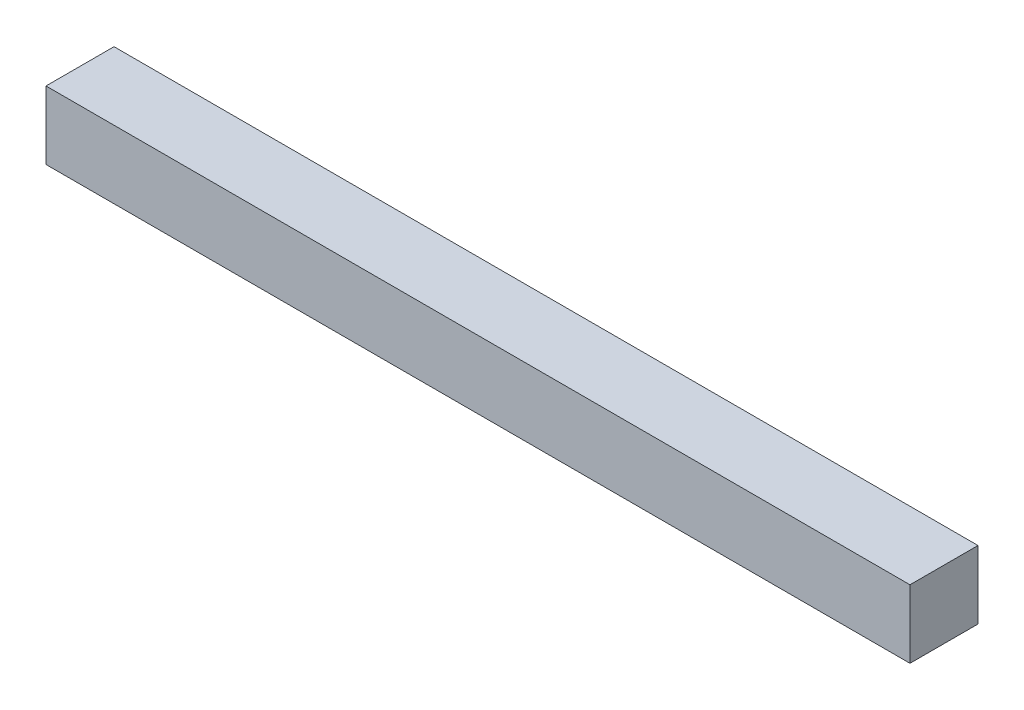
ISO-10303-21;
HEADER;
FILE_DESCRIPTION(('STEP AP214'),'2;1');
FILE_NAME('part.step','',(''),(''),'','','');
FILE_SCHEMA(('AUTOMOTIVE_DESIGN { 1 0 10303 214 1 1 1 1 }'));
ENDSEC;
DATA;
#1=APPLICATION_CONTEXT('core data for automotive mechanical design processes');
#2=APPLICATION_PROTOCOL_DEFINITION('international standard','automotive_design',2000,#1);
#3=PRODUCT_CONTEXT('',#1,'mechanical');
#4=PRODUCT('Part','Part','',(#3));
#5=PRODUCT_RELATED_PRODUCT_CATEGORY('part','',(#4));
#6=PRODUCT_DEFINITION_FORMATION('','',#4);
#7=PRODUCT_DEFINITION_CONTEXT('part definition',#1,'design');
#8=PRODUCT_DEFINITION('design','',#6,#7);
#9=PRODUCT_DEFINITION_SHAPE('','',#8);
#10=(LENGTH_UNIT() NAMED_UNIT(*) SI_UNIT(.MILLI.,.METRE.));
#11=(NAMED_UNIT(*) PLANE_ANGLE_UNIT() SI_UNIT($,.RADIAN.));
#12=(NAMED_UNIT(*) SI_UNIT($,.STERADIAN.) SOLID_ANGLE_UNIT());
#13=UNCERTAINTY_MEASURE_WITH_UNIT(LENGTH_MEASURE(1.E-05),#10,'distance_accuracy_value','');
#14=(GEOMETRIC_REPRESENTATION_CONTEXT(3) GLOBAL_UNCERTAINTY_ASSIGNED_CONTEXT((#13)) GLOBAL_UNIT_ASSIGNED_CONTEXT((#10,
#11,#12)) REPRESENTATION_CONTEXT('',''));
#15=CARTESIAN_POINT('',(0.,0.,0.));
#16=DIRECTION('',(0.,0.,1.));
#17=DIRECTION('',(1.,0.,0.));
#18=AXIS2_PLACEMENT_3D('',#15,#16,#17);
#19=CARTESIAN_POINT('',(-14.700580947984,5.16081871345029,10.));
#20=DIRECTION('',(0.,1.,0.));
#21=DIRECTION('',(0.,0.,1.));
#22=AXIS2_PLACEMENT_3D('',#19,#20,#21);
#23=PLANE('',#22);
#24=DIRECTION('',(1.,0.,0.));
#25=VECTOR('',#24,1.);
#26=CARTESIAN_POINT('',(-14.700580947984,5.16081871345029,0.));
#27=LINE('',#26,#25);
#28=CARTESIAN_POINT('',(-14.700580947984,5.16081871345029,0.));
#29=VERTEX_POINT('',#28);
#30=CARTESIAN_POINT('',(112.299419052016,5.16081871345029,0.));
#31=VERTEX_POINT('',#30);
#32=EDGE_CURVE('E98',#29,#31,#27,.T.);
#33=ORIENTED_EDGE('',*,*,#32,.F.);
#34=DIRECTION('',(0.,0.,-1.));
#35=VECTOR('',#34,1.);
#36=CARTESIAN_POINT('',(-14.700580947984,5.16081871345029,10.));
#37=LINE('',#36,#35);
#38=CARTESIAN_POINT('',(-14.700580947984,5.16081871345029,10.));
#39=VERTEX_POINT('',#38);
#40=EDGE_CURVE('E11',#39,#29,#37,.T.);
#41=ORIENTED_EDGE('',*,*,#40,.F.);
#42=DIRECTION('',(1.,0.,0.));
#43=VECTOR('',#42,1.);
#44=CARTESIAN_POINT('',(-14.700580947984,5.16081871345029,10.));
#45=LINE('',#44,#43);
#46=CARTESIAN_POINT('',(112.299419052016,5.16081871345029,10.));
#47=VERTEX_POINT('',#46);
#48=EDGE_CURVE('E93',#39,#47,#45,.T.);
#49=ORIENTED_EDGE('',*,*,#48,.T.);
#50=DIRECTION('',(0.,0.,-1.));
#51=VECTOR('',#50,1.);
#52=CARTESIAN_POINT('',(112.299419052016,5.16081871345029,10.));
#53=LINE('',#52,#51);
#54=EDGE_CURVE('E36',#47,#31,#53,.T.);
#55=ORIENTED_EDGE('',*,*,#54,.T.);
#56=EDGE_LOOP('',(#33,#41,#49,#55));
#57=FACE_BOUND('',#56,.T.);
#58=ADVANCED_FACE('F33',(#57),#23,.T.);
#59=CARTESIAN_POINT('',(-14.700580947984,5.16081871345029,10.));
#60=DIRECTION('',(1.,0.,0.));
#61=DIRECTION('',(0.,0.,-1.));
#62=AXIS2_PLACEMENT_3D('',#59,#60,#61);
#63=PLANE('',#62);
#64=DIRECTION('',(0.,-1.,0.));
#65=VECTOR('',#64,1.);
#66=CARTESIAN_POINT('',(-14.700580947984,5.16081871345029,0.));
#67=LINE('',#66,#65);
#68=CARTESIAN_POINT('',(-14.700580947984,-4.83918128654971,0.));
#69=VERTEX_POINT('',#68);
#70=EDGE_CURVE('E66',#29,#69,#67,.T.);
#71=ORIENTED_EDGE('',*,*,#70,.T.);
#72=DIRECTION('',(0.,0.,-1.));
#73=VECTOR('',#72,1.);
#74=CARTESIAN_POINT('',(-14.700580947984,-4.83918128654971,10.));
#75=LINE('',#74,#73);
#76=CARTESIAN_POINT('',(-14.700580947984,-4.83918128654971,10.));
#77=VERTEX_POINT('',#76);
#78=EDGE_CURVE('E42',#77,#69,#75,.T.);
#79=ORIENTED_EDGE('',*,*,#78,.F.);
#80=DIRECTION('',(0.,-1.,0.));
#81=VECTOR('',#80,1.);
#82=CARTESIAN_POINT('',(-14.700580947984,5.16081871345029,10.));
#83=LINE('',#82,#81);
#84=EDGE_CURVE('E83',#39,#77,#83,.T.);
#85=ORIENTED_EDGE('',*,*,#84,.F.);
#86=ORIENTED_EDGE('',*,*,#40,.T.);
#87=EDGE_LOOP('',(#71,#79,#85,#86));
#88=FACE_BOUND('',#87,.T.);
#89=ADVANCED_FACE('F108',(#88),#63,.F.);
#90=CARTESIAN_POINT('',(-14.700580947984,-4.83918128654971,10.));
#91=DIRECTION('',(0.,1.,0.));
#92=DIRECTION('',(0.,0.,1.));
#93=AXIS2_PLACEMENT_3D('',#90,#91,#92);
#94=PLANE('',#93);
#95=DIRECTION('',(1.,0.,0.));
#96=VECTOR('',#95,1.);
#97=CARTESIAN_POINT('',(-14.700580947984,-4.83918128654971,0.));
#98=LINE('',#97,#96);
#99=CARTESIAN_POINT('',(112.299419052016,-4.83918128654971,0.));
#100=VERTEX_POINT('',#99);
#101=EDGE_CURVE('E90',#69,#100,#98,.T.);
#102=ORIENTED_EDGE('',*,*,#101,.T.);
#103=DIRECTION('',(0.,0.,-1.));
#104=VECTOR('',#103,1.);
#105=CARTESIAN_POINT('',(112.299419052016,-4.83918128654971,10.));
#106=LINE('',#105,#104);
#107=CARTESIAN_POINT('',(112.299419052016,-4.83918128654971,10.));
#108=VERTEX_POINT('',#107);
#109=EDGE_CURVE('E87',#108,#100,#106,.T.);
#110=ORIENTED_EDGE('',*,*,#109,.F.);
#111=DIRECTION('',(1.,0.,0.));
#112=VECTOR('',#111,1.);
#113=CARTESIAN_POINT('',(-14.700580947984,-4.83918128654971,10.));
#114=LINE('',#113,#112);
#115=EDGE_CURVE('E78',#77,#108,#114,.T.);
#116=ORIENTED_EDGE('',*,*,#115,.F.);
#117=ORIENTED_EDGE('',*,*,#78,.T.);
#118=EDGE_LOOP('',(#102,#110,#116,#117));
#119=FACE_BOUND('',#118,.T.);
#120=ADVANCED_FACE('F88',(#119),#94,.F.);
#121=CARTESIAN_POINT('',(112.299419052016,5.16081871345029,10.));
#122=DIRECTION('',(1.,0.,0.));
#123=DIRECTION('',(0.,0.,-1.));
#124=AXIS2_PLACEMENT_3D('',#121,#122,#123);
#125=PLANE('',#124);
#126=DIRECTION('',(0.,-1.,0.));
#127=VECTOR('',#126,1.);
#128=CARTESIAN_POINT('',(112.299419052016,5.16081871345029,0.));
#129=LINE('',#128,#127);
#130=EDGE_CURVE('E101',#31,#100,#129,.T.);
#131=ORIENTED_EDGE('',*,*,#130,.F.);
#132=ORIENTED_EDGE('',*,*,#54,.F.);
#133=DIRECTION('',(0.,-1.,0.));
#134=VECTOR('',#133,1.);
#135=CARTESIAN_POINT('',(112.299419052016,5.16081871345029,10.));
#136=LINE('',#135,#134);
#137=EDGE_CURVE('E82',#47,#108,#136,.T.);
#138=ORIENTED_EDGE('',*,*,#137,.T.);
#139=ORIENTED_EDGE('',*,*,#109,.T.);
#140=EDGE_LOOP('',(#131,#132,#138,#139));
#141=FACE_BOUND('',#140,.T.);
#142=ADVANCED_FACE('F92',(#141),#125,.T.);
#143=CARTESIAN_POINT('',(0.,0.,10.));
#144=DIRECTION('',(0.,0.,-1.));
#145=DIRECTION('',(-1.,0.,0.));
#146=AXIS2_PLACEMENT_3D('',#143,#144,#145);
#147=PLANE('',#146);
#148=ORIENTED_EDGE('',*,*,#48,.F.);
#149=ORIENTED_EDGE('',*,*,#84,.T.);
#150=ORIENTED_EDGE('',*,*,#115,.T.);
#151=ORIENTED_EDGE('',*,*,#137,.F.);
#152=EDGE_LOOP('',(#148,#149,#150,#151));
#153=FACE_BOUND('',#152,.T.);
#154=ADVANCED_FACE('F81',(#153),#147,.F.);
#155=CARTESIAN_POINT('',(0.,0.,0.));
#156=DIRECTION('',(0.,0.,-1.));
#157=DIRECTION('',(-1.,0.,0.));
#158=AXIS2_PLACEMENT_3D('',#155,#156,#157);
#159=PLANE('',#158);
#160=ORIENTED_EDGE('',*,*,#32,.T.);
#161=ORIENTED_EDGE('',*,*,#130,.T.);
#162=ORIENTED_EDGE('',*,*,#101,.F.);
#163=ORIENTED_EDGE('',*,*,#70,.F.);
#164=EDGE_LOOP('',(#160,#161,#162,#163));
#165=FACE_BOUND('',#164,.T.);
#166=ADVANCED_FACE('F106',(#165),#159,.T.);
#167=CLOSED_SHELL('',(#58,#89,#120,#142,#154,#166));
#168=MANIFOLD_SOLID_BREP('B2',#167);
#169=ADVANCED_BREP_SHAPE_REPRESENTATION('',(#18,#168),#14);
#170=SHAPE_DEFINITION_REPRESENTATION(#9,#169);
ENDSEC;
END-ISO-10303-21;
